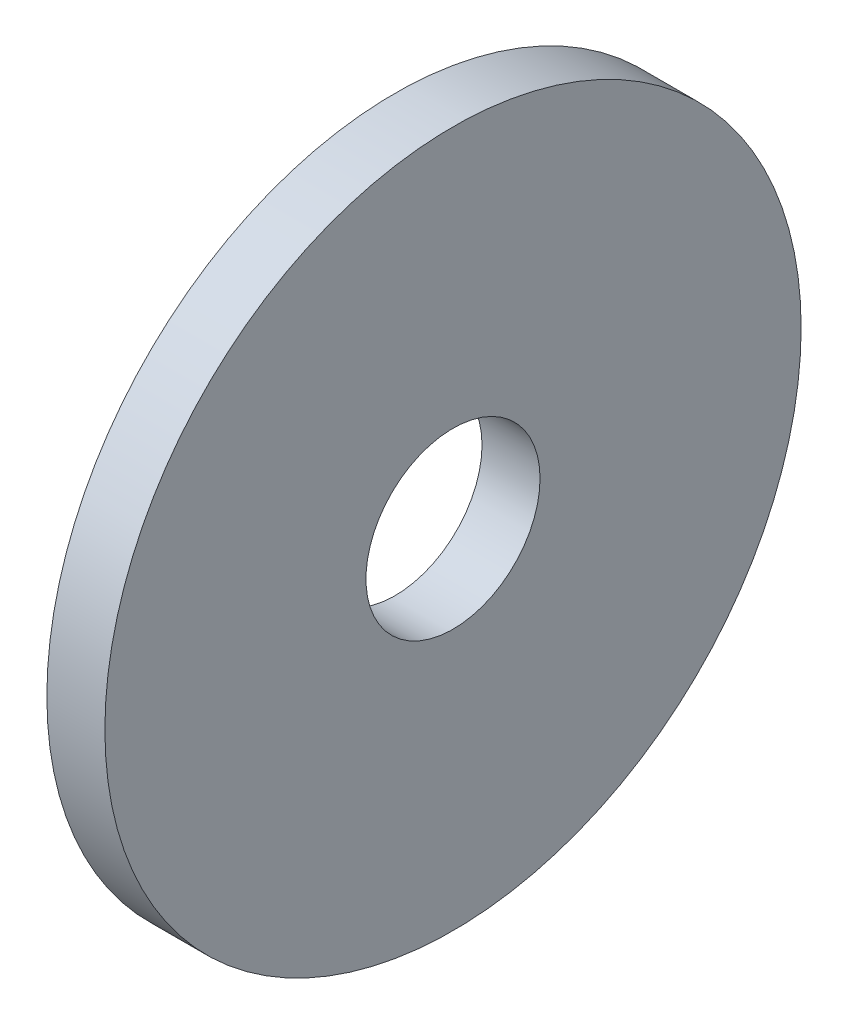
ISO-10303-21;
HEADER;
FILE_DESCRIPTION(('STEP AP214'),'2;1');
FILE_NAME('part.step','',(''),(''),'','','');
FILE_SCHEMA(('AUTOMOTIVE_DESIGN { 1 0 10303 214 1 1 1 1 }'));
ENDSEC;
DATA;
#1=APPLICATION_CONTEXT('core data for automotive mechanical design processes');
#2=APPLICATION_PROTOCOL_DEFINITION('international standard','automotive_design',2000,#1);
#3=PRODUCT_CONTEXT('',#1,'mechanical');
#4=PRODUCT('Part','Part','',(#3));
#5=PRODUCT_RELATED_PRODUCT_CATEGORY('part','',(#4));
#6=PRODUCT_DEFINITION_FORMATION('','',#4);
#7=PRODUCT_DEFINITION_CONTEXT('part definition',#1,'design');
#8=PRODUCT_DEFINITION('design','',#6,#7);
#9=PRODUCT_DEFINITION_SHAPE('','',#8);
#10=(LENGTH_UNIT() NAMED_UNIT(*) SI_UNIT(.MILLI.,.METRE.));
#11=(NAMED_UNIT(*) PLANE_ANGLE_UNIT() SI_UNIT($,.RADIAN.));
#12=(NAMED_UNIT(*) SI_UNIT($,.STERADIAN.) SOLID_ANGLE_UNIT());
#13=UNCERTAINTY_MEASURE_WITH_UNIT(LENGTH_MEASURE(1.E-05),#10,'distance_accuracy_value','');
#14=(GEOMETRIC_REPRESENTATION_CONTEXT(3) GLOBAL_UNCERTAINTY_ASSIGNED_CONTEXT((#13)) GLOBAL_UNIT_ASSIGNED_CONTEXT((#10,
#11,#12)) REPRESENTATION_CONTEXT('',''));
#15=CARTESIAN_POINT('',(0.,0.,0.));
#16=DIRECTION('',(0.,0.,1.));
#17=DIRECTION('',(1.,0.,0.));
#18=AXIS2_PLACEMENT_3D('',#15,#16,#17);
#19=CARTESIAN_POINT('',(2.,0.,0.));
#20=DIRECTION('',(-1.,0.,0.));
#21=DIRECTION('',(0.,0.,1.));
#22=AXIS2_PLACEMENT_3D('',#19,#20,#21);
#23=CYLINDRICAL_SURFACE('',#22,12.);
#24=CARTESIAN_POINT('',(2.,0.,0.));
#25=DIRECTION('',(1.,0.,0.));
#26=DIRECTION('',(0.,0.,-1.));
#27=AXIS2_PLACEMENT_3D('',#24,#25,#26);
#28=CIRCLE('',#27,12.);
#29=CARTESIAN_POINT('',(2.,0.,-12.));
#30=VERTEX_POINT('',#29);
#31=EDGE_CURVE('E10',#30,#30,#28,.T.);
#32=ORIENTED_EDGE('',*,*,#31,.F.);
#33=EDGE_LOOP('',(#32));
#34=FACE_BOUND('',#33,.T.);
#35=CARTESIAN_POINT('',(0.,0.,0.));
#36=DIRECTION('',(1.,0.,0.));
#37=DIRECTION('',(0.,0.,-1.));
#38=AXIS2_PLACEMENT_3D('',#35,#36,#37);
#39=CIRCLE('',#38,12.);
#40=CARTESIAN_POINT('',(0.,0.,-12.));
#41=VERTEX_POINT('',#40);
#42=EDGE_CURVE('E34',#41,#41,#39,.T.);
#43=ORIENTED_EDGE('',*,*,#42,.T.);
#44=EDGE_LOOP('',(#43));
#45=FACE_BOUND('',#44,.T.);
#46=ADVANCED_FACE('F31',(#34,#45),#23,.T.);
#47=CARTESIAN_POINT('',(2.,0.,0.));
#48=DIRECTION('',(1.,0.,0.));
#49=DIRECTION('',(0.,0.,-1.));
#50=AXIS2_PLACEMENT_3D('',#47,#48,#49);
#51=PLANE('',#50);
#52=CARTESIAN_POINT('',(2.,0.,0.));
#53=DIRECTION('',(1.,0.,0.));
#54=DIRECTION('',(0.,0.,-1.));
#55=AXIS2_PLACEMENT_3D('',#52,#53,#54);
#56=CIRCLE('',#55,3.);
#57=CARTESIAN_POINT('',(2.,0.,-3.));
#58=VERTEX_POINT('',#57);
#59=EDGE_CURVE('E41',#58,#58,#56,.T.);
#60=ORIENTED_EDGE('',*,*,#59,.F.);
#61=EDGE_LOOP('',(#60));
#62=FACE_BOUND('',#61,.T.);
#63=ORIENTED_EDGE('',*,*,#31,.T.);
#64=EDGE_LOOP('',(#63));
#65=FACE_BOUND('',#64,.T.);
#66=ADVANCED_FACE('F59',(#62,#65),#51,.T.);
#67=CARTESIAN_POINT('',(0.,0.,0.));
#68=DIRECTION('',(1.,0.,0.));
#69=DIRECTION('',(0.,0.,-1.));
#70=AXIS2_PLACEMENT_3D('',#67,#68,#69);
#71=PLANE('',#70);
#72=CARTESIAN_POINT('',(0.,0.,0.));
#73=DIRECTION('',(1.,0.,0.));
#74=DIRECTION('',(0.,0.,-1.));
#75=AXIS2_PLACEMENT_3D('',#72,#73,#74);
#76=CIRCLE('',#75,3.);
#77=CARTESIAN_POINT('',(0.,0.,-3.));
#78=VERTEX_POINT('',#77);
#79=EDGE_CURVE('E45',#78,#78,#76,.T.);
#80=ORIENTED_EDGE('',*,*,#79,.T.);
#81=EDGE_LOOP('',(#80));
#82=FACE_BOUND('',#81,.T.);
#83=ORIENTED_EDGE('',*,*,#42,.F.);
#84=EDGE_LOOP('',(#83));
#85=FACE_BOUND('',#84,.T.);
#86=ADVANCED_FACE('F49',(#82,#85),#71,.F.);
#87=CARTESIAN_POINT('',(0.,0.,0.));
#88=DIRECTION('',(1.,0.,0.));
#89=DIRECTION('',(0.,0.,-1.));
#90=AXIS2_PLACEMENT_3D('',#87,#88,#89);
#91=CYLINDRICAL_SURFACE('',#90,3.);
#92=ORIENTED_EDGE('',*,*,#59,.T.);
#93=EDGE_LOOP('',(#92));
#94=FACE_BOUND('',#93,.T.);
#95=ORIENTED_EDGE('',*,*,#79,.F.);
#96=EDGE_LOOP('',(#95));
#97=FACE_BOUND('',#96,.T.);
#98=ADVANCED_FACE('F52',(#94,#97),#91,.F.);
#99=CLOSED_SHELL('',(#46,#66,#86,#98));
#100=MANIFOLD_SOLID_BREP('B2',#99);
#101=ADVANCED_BREP_SHAPE_REPRESENTATION('',(#18,#100),#14);
#102=SHAPE_DEFINITION_REPRESENTATION(#9,#101);
ENDSEC;
END-ISO-10303-21;
